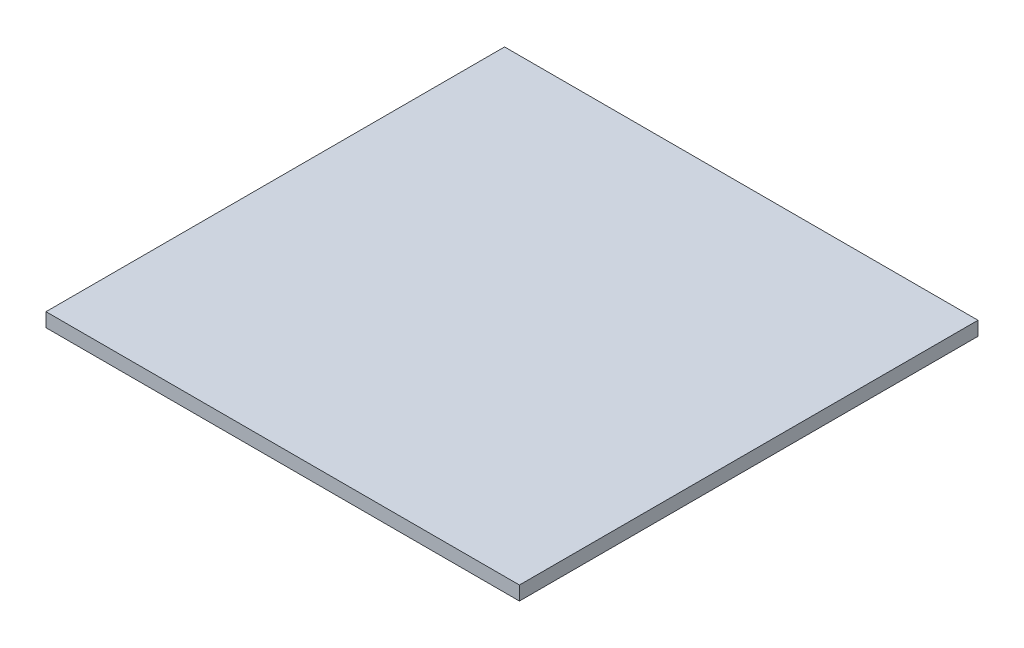
ISO-10303-21;
HEADER;
FILE_DESCRIPTION(('STEP AP214'),'2;1');
FILE_NAME('part.step','',(''),(''),'','','');
FILE_SCHEMA(('AUTOMOTIVE_DESIGN { 1 0 10303 214 1 1 1 1 }'));
ENDSEC;
DATA;
#1=APPLICATION_CONTEXT('core data for automotive mechanical design processes');
#2=APPLICATION_PROTOCOL_DEFINITION('international standard','automotive_design',2000,#1);
#3=PRODUCT_CONTEXT('',#1,'mechanical');
#4=PRODUCT('Part','Part','',(#3));
#5=PRODUCT_RELATED_PRODUCT_CATEGORY('part','',(#4));
#6=PRODUCT_DEFINITION_FORMATION('','',#4);
#7=PRODUCT_DEFINITION_CONTEXT('part definition',#1,'design');
#8=PRODUCT_DEFINITION('design','',#6,#7);
#9=PRODUCT_DEFINITION_SHAPE('','',#8);
#10=(LENGTH_UNIT() NAMED_UNIT(*) SI_UNIT(.MILLI.,.METRE.));
#11=(NAMED_UNIT(*) PLANE_ANGLE_UNIT() SI_UNIT($,.RADIAN.));
#12=(NAMED_UNIT(*) SI_UNIT($,.STERADIAN.) SOLID_ANGLE_UNIT());
#13=UNCERTAINTY_MEASURE_WITH_UNIT(LENGTH_MEASURE(1.E-05),#10,'distance_accuracy_value','');
#14=(GEOMETRIC_REPRESENTATION_CONTEXT(3) GLOBAL_UNCERTAINTY_ASSIGNED_CONTEXT((#13)) GLOBAL_UNIT_ASSIGNED_CONTEXT((#10,
#11,#12)) REPRESENTATION_CONTEXT('',''));
#15=CARTESIAN_POINT('',(0.,0.,0.));
#16=DIRECTION('',(0.,0.,1.));
#17=DIRECTION('',(1.,0.,0.));
#18=AXIS2_PLACEMENT_3D('',#15,#16,#17);
#19=CARTESIAN_POINT('',(-44.2815420560747,3.,-20.6980140186916));
#20=DIRECTION('',(1.,0.,0.));
#21=DIRECTION('',(0.,0.,-1.));
#22=AXIS2_PLACEMENT_3D('',#19,#20,#21);
#23=PLANE('',#22);
#24=DIRECTION('',(0.,0.,1.));
#25=VECTOR('',#24,1.);
#26=CARTESIAN_POINT('',(-44.2815420560747,0.,-20.6980140186916));
#27=LINE('',#26,#25);
#28=CARTESIAN_POINT('',(-44.2815420560747,0.,-20.6980140186916));
#29=VERTEX_POINT('',#28);
#30=CARTESIAN_POINT('',(-44.2815420560747,0.,78.1019859813084));
#31=VERTEX_POINT('',#30);
#32=EDGE_CURVE('E96',#29,#31,#27,.T.);
#33=ORIENTED_EDGE('',*,*,#32,.T.);
#34=DIRECTION('',(0.,-1.,0.));
#35=VECTOR('',#34,1.);
#36=CARTESIAN_POINT('',(-44.2815420560747,3.,78.1019859813084));
#37=LINE('',#36,#35);
#38=CARTESIAN_POINT('',(-44.2815420560747,3.,78.1019859813084));
#39=VERTEX_POINT('',#38);
#40=EDGE_CURVE('E11',#39,#31,#37,.T.);
#41=ORIENTED_EDGE('',*,*,#40,.F.);
#42=DIRECTION('',(0.,0.,1.));
#43=VECTOR('',#42,1.);
#44=CARTESIAN_POINT('',(-44.2815420560747,3.,-20.6980140186916));
#45=LINE('',#44,#43);
#46=CARTESIAN_POINT('',(-44.2815420560747,3.,-20.6980140186916));
#47=VERTEX_POINT('',#46);
#48=EDGE_CURVE('E84',#47,#39,#45,.T.);
#49=ORIENTED_EDGE('',*,*,#48,.F.);
#50=DIRECTION('',(0.,-1.,0.));
#51=VECTOR('',#50,1.);
#52=CARTESIAN_POINT('',(-44.2815420560747,3.,-20.6980140186916));
#53=LINE('',#52,#51);
#54=EDGE_CURVE('E92',#47,#29,#53,.T.);
#55=ORIENTED_EDGE('',*,*,#54,.T.);
#56=EDGE_LOOP('',(#33,#41,#49,#55));
#57=FACE_BOUND('',#56,.T.);
#58=ADVANCED_FACE('F33',(#57),#23,.F.);
#59=CARTESIAN_POINT('',(-44.2815420560747,3.,78.1019859813084));
#60=DIRECTION('',(0.,0.,-1.));
#61=DIRECTION('',(-1.,0.,0.));
#62=AXIS2_PLACEMENT_3D('',#59,#60,#61);
#63=PLANE('',#62);
#64=DIRECTION('',(1.,0.,0.));
#65=VECTOR('',#64,1.);
#66=CARTESIAN_POINT('',(-44.2815420560747,0.,78.1019859813084));
#67=LINE('',#66,#65);
#68=CARTESIAN_POINT('',(57.7184579439253,0.,78.1019859813084));
#69=VERTEX_POINT('',#68);
#70=EDGE_CURVE('E88',#31,#69,#67,.T.);
#71=ORIENTED_EDGE('',*,*,#70,.T.);
#72=DIRECTION('',(0.,-1.,0.));
#73=VECTOR('',#72,1.);
#74=CARTESIAN_POINT('',(57.7184579439253,3.,78.1019859813084));
#75=LINE('',#74,#73);
#76=CARTESIAN_POINT('',(57.7184579439253,3.,78.1019859813084));
#77=VERTEX_POINT('',#76);
#78=EDGE_CURVE('E41',#77,#69,#75,.T.);
#79=ORIENTED_EDGE('',*,*,#78,.F.);
#80=DIRECTION('',(1.,0.,0.));
#81=VECTOR('',#80,1.);
#82=CARTESIAN_POINT('',(-44.2815420560747,3.,78.1019859813084));
#83=LINE('',#82,#81);
#84=EDGE_CURVE('E79',#39,#77,#83,.T.);
#85=ORIENTED_EDGE('',*,*,#84,.F.);
#86=ORIENTED_EDGE('',*,*,#40,.T.);
#87=EDGE_LOOP('',(#71,#79,#85,#86));
#88=FACE_BOUND('',#87,.T.);
#89=ADVANCED_FACE('F87',(#88),#63,.F.);
#90=CARTESIAN_POINT('',(57.7184579439252,3.,-20.6980140186916));
#91=DIRECTION('',(-1.,0.,0.));
#92=DIRECTION('',(0.,0.,1.));
#93=AXIS2_PLACEMENT_3D('',#90,#91,#92);
#94=PLANE('',#93);
#95=DIRECTION('',(0.,0.,-1.));
#96=VECTOR('',#95,1.);
#97=CARTESIAN_POINT('',(57.7184579439252,0.,-20.6980140186916));
#98=LINE('',#97,#96);
#99=CARTESIAN_POINT('',(57.7184579439252,0.,-20.6980140186916));
#100=VERTEX_POINT('',#99);
#101=EDGE_CURVE('E66',#69,#100,#98,.T.);
#102=ORIENTED_EDGE('',*,*,#101,.T.);
#103=DIRECTION('',(0.,-1.,0.));
#104=VECTOR('',#103,1.);
#105=CARTESIAN_POINT('',(57.7184579439252,3.,-20.6980140186916));
#106=LINE('',#105,#104);
#107=CARTESIAN_POINT('',(57.7184579439252,3.,-20.6980140186916));
#108=VERTEX_POINT('',#107);
#109=EDGE_CURVE('E89',#108,#100,#106,.T.);
#110=ORIENTED_EDGE('',*,*,#109,.F.);
#111=DIRECTION('',(0.,0.,-1.));
#112=VECTOR('',#111,1.);
#113=CARTESIAN_POINT('',(57.7184579439252,3.,-20.6980140186916));
#114=LINE('',#113,#112);
#115=EDGE_CURVE('E82',#77,#108,#114,.T.);
#116=ORIENTED_EDGE('',*,*,#115,.F.);
#117=ORIENTED_EDGE('',*,*,#78,.T.);
#118=EDGE_LOOP('',(#102,#110,#116,#117));
#119=FACE_BOUND('',#118,.T.);
#120=ADVANCED_FACE('F90',(#119),#94,.F.);
#121=CARTESIAN_POINT('',(-44.2815420560747,3.,-20.6980140186916));
#122=DIRECTION('',(0.,0.,1.));
#123=DIRECTION('',(1.,0.,0.));
#124=AXIS2_PLACEMENT_3D('',#121,#122,#123);
#125=PLANE('',#124);
#126=DIRECTION('',(-1.,0.,0.));
#127=VECTOR('',#126,1.);
#128=CARTESIAN_POINT('',(-44.2815420560747,0.,-20.6980140186916));
#129=LINE('',#128,#127);
#130=EDGE_CURVE('E72',#100,#29,#129,.T.);
#131=ORIENTED_EDGE('',*,*,#130,.T.);
#132=ORIENTED_EDGE('',*,*,#54,.F.);
#133=DIRECTION('',(-1.,0.,0.));
#134=VECTOR('',#133,1.);
#135=CARTESIAN_POINT('',(-44.2815420560747,3.,-20.6980140186916));
#136=LINE('',#135,#134);
#137=EDGE_CURVE('E49',#108,#47,#136,.T.);
#138=ORIENTED_EDGE('',*,*,#137,.F.);
#139=ORIENTED_EDGE('',*,*,#109,.T.);
#140=EDGE_LOOP('',(#131,#132,#138,#139));
#141=FACE_BOUND('',#140,.T.);
#142=ADVANCED_FACE('F103',(#141),#125,.F.);
#143=CARTESIAN_POINT('',(0.,3.,0.));
#144=DIRECTION('',(0.,1.,0.));
#145=DIRECTION('',(0.,0.,1.));
#146=AXIS2_PLACEMENT_3D('',#143,#144,#145);
#147=PLANE('',#146);
#148=ORIENTED_EDGE('',*,*,#48,.T.);
#149=ORIENTED_EDGE('',*,*,#84,.T.);
#150=ORIENTED_EDGE('',*,*,#115,.T.);
#151=ORIENTED_EDGE('',*,*,#137,.T.);
#152=EDGE_LOOP('',(#148,#149,#150,#151));
#153=FACE_BOUND('',#152,.T.);
#154=ADVANCED_FACE('F80',(#153),#147,.T.);
#155=CARTESIAN_POINT('',(0.,0.,0.));
#156=DIRECTION('',(0.,1.,0.));
#157=DIRECTION('',(0.,0.,1.));
#158=AXIS2_PLACEMENT_3D('',#155,#156,#157);
#159=PLANE('',#158);
#160=ORIENTED_EDGE('',*,*,#32,.F.);
#161=ORIENTED_EDGE('',*,*,#130,.F.);
#162=ORIENTED_EDGE('',*,*,#101,.F.);
#163=ORIENTED_EDGE('',*,*,#70,.F.);
#164=EDGE_LOOP('',(#160,#161,#162,#163));
#165=FACE_BOUND('',#164,.T.);
#166=ADVANCED_FACE('F106',(#165),#159,.F.);
#167=CLOSED_SHELL('',(#58,#89,#120,#142,#154,#166));
#168=MANIFOLD_SOLID_BREP('B2',#167);
#169=ADVANCED_BREP_SHAPE_REPRESENTATION('',(#18,#168),#14);
#170=SHAPE_DEFINITION_REPRESENTATION(#9,#169);
ENDSEC;
END-ISO-10303-21;
